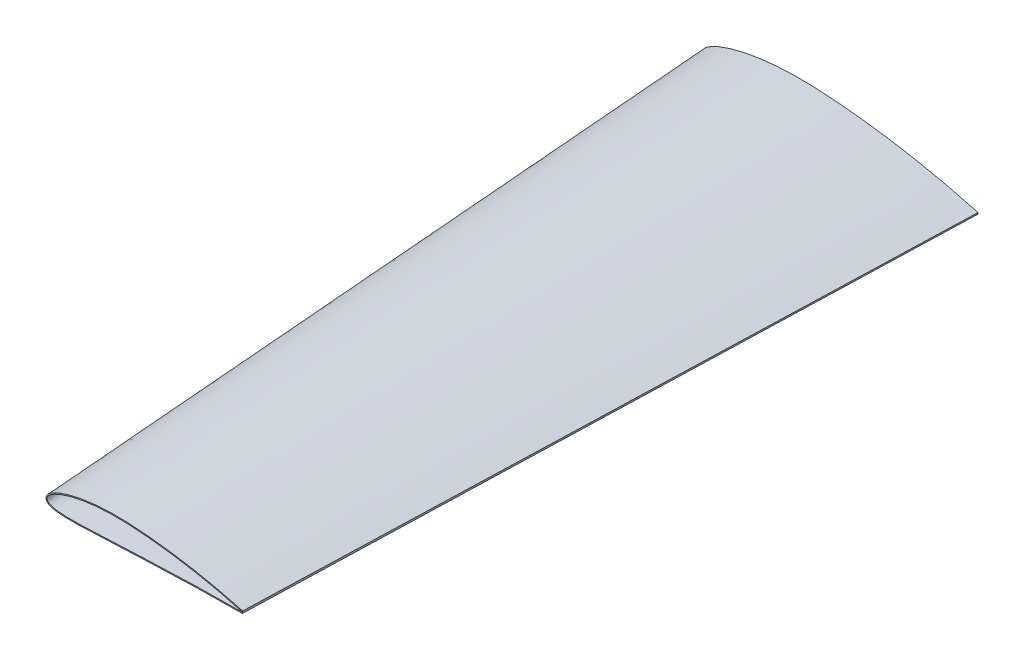
ISO-10303-21;
HEADER;
FILE_DESCRIPTION(('STEP AP214'),'2;1');
FILE_NAME('part.step','',(''),(''),'','','');
FILE_SCHEMA(('AUTOMOTIVE_DESIGN { 1 0 10303 214 1 1 1 1 }'));
ENDSEC;
DATA;
#1=APPLICATION_CONTEXT('core data for automotive mechanical design processes');
#2=APPLICATION_PROTOCOL_DEFINITION('international standard','automotive_design',2000,#1);
#3=PRODUCT_CONTEXT('',#1,'mechanical');
#4=PRODUCT('Part','Part','',(#3));
#5=PRODUCT_RELATED_PRODUCT_CATEGORY('part','',(#4));
#6=PRODUCT_DEFINITION_FORMATION('','',#4);
#7=PRODUCT_DEFINITION_CONTEXT('part definition',#1,'design');
#8=PRODUCT_DEFINITION('design','',#6,#7);
#9=PRODUCT_DEFINITION_SHAPE('','',#8);
#10=(LENGTH_UNIT() NAMED_UNIT(*) SI_UNIT(.MILLI.,.METRE.));
#11=(NAMED_UNIT(*) PLANE_ANGLE_UNIT() SI_UNIT($,.RADIAN.));
#12=(NAMED_UNIT(*) SI_UNIT($,.STERADIAN.) SOLID_ANGLE_UNIT());
#13=UNCERTAINTY_MEASURE_WITH_UNIT(LENGTH_MEASURE(1.E-05),#10,'distance_accuracy_value','');
#14=(GEOMETRIC_REPRESENTATION_CONTEXT(3) GLOBAL_UNCERTAINTY_ASSIGNED_CONTEXT((#13)) GLOBAL_UNIT_ASSIGNED_CONTEXT((#10,
#11,#12)) REPRESENTATION_CONTEXT('',''));
#15=CARTESIAN_POINT('',(0.,0.,0.));
#16=DIRECTION('',(0.,0.,1.));
#17=DIRECTION('',(1.,0.,0.));
#18=AXIS2_PLACEMENT_3D('',#15,#16,#17);
#19=CARTESIAN_POINT('',(515.542466757651,1.37291715323749,0.));
#20=CARTESIAN_POINT('',(473.761354348708,1.91504334392476,1333.5));
#21=CARTESIAN_POINT('',(504.948186056162,4.31562778068404,0.));
#22=CARTESIAN_POINT('',(466.241241660713,4.00387151815679,1333.5));
#23=CARTESIAN_POINT('',(483.688630885925,9.95175823918553,0.));
#24=CARTESIAN_POINT('',(451.160493971408,8.03690502890336,1333.5));
#25=CARTESIAN_POINT('',(440.91840439398,20.2408017386491,0.));
#26=CARTESIAN_POINT('',(420.805599887962,15.3578375738474,1333.5));
#27=CARTESIAN_POINT('',(397.820792051191,29.0759377638442,0.));
#28=CARTESIAN_POINT('',(390.221957363054,21.65962794748,1333.5));
#29=CARTESIAN_POINT('',(354.460600672312,36.4782376927597,0.));
#30=CARTESIAN_POINT('',(359.448862171338,26.9396472162238,1333.5));
#31=CARTESIAN_POINT('',(321.821436127745,41.287280697128,0.));
#32=CARTESIAN_POINT('',(336.282822397605,30.3682918829064,1333.5));
#33=CARTESIAN_POINT('',(289.075414397088,45.3159399144746,0.));
#34=CARTESIAN_POINT('',(313.039072197383,33.2450825322831,1333.5));
#35=CARTESIAN_POINT('',(256.234249309476,48.5142512287238,0.));
#36=CARTESIAN_POINT('',(289.723976775768,35.5318134186845,1333.5));
#37=CARTESIAN_POINT('',(223.317458576892,50.787173233681,0.));
#38=CARTESIAN_POINT('',(266.354818287414,37.1599691175304,1333.5));
#39=CARTESIAN_POINT('',(190.328241158101,52.0921492363557,0.));
#40=CARTESIAN_POINT('',(242.91690860674,38.106258583374,1333.5));
#41=CARTESIAN_POINT('',(162.799790856734,51.7149612737425,0.));
#42=CARTESIAN_POINT('',(223.339605024856,37.8569374336063,1333.5));
#43=CARTESIAN_POINT('',(140.815010685056,50.4814113602434,0.));
#44=CARTESIAN_POINT('',(207.702823599273,36.9927518576321,1333.5));
#45=CARTESIAN_POINT('',(124.359909385153,49.0521108646724,0.));
#46=CARTESIAN_POINT('',(195.99602938729,35.9854835703815,1333.5));
#47=CARTESIAN_POINT('',(107.957329171461,47.0863508807158,0.));
#48=CARTESIAN_POINT('',(184.323035776176,34.59573007404,1333.5));
#49=CARTESIAN_POINT('',(91.631280061329,44.5372092186544,0.));
#50=CARTESIAN_POINT('',(172.700036204777,32.7897404844962,1333.5));
#51=CARTESIAN_POINT('',(75.4136360051635,41.3429509123251,0.));
#52=CARTESIAN_POINT('',(161.148094659947,30.5229468259909,1333.5));
#53=CARTESIAN_POINT('',(62.025702194082,38.0735505204426,0.));
#54=CARTESIAN_POINT('',(151.604465980378,28.1992444571214,1333.5));
#55=CARTESIAN_POINT('',(51.4266197848401,35.0260164169072,0.));
#56=CARTESIAN_POINT('',(144.041887446398,26.0301562795153,1333.5));
#57=CARTESIAN_POINT('',(43.5465568697689,32.4984583099507,0.));
#58=CARTESIAN_POINT('',(138.41449545024,24.2291788913945,1333.5));
#59=CARTESIAN_POINT('',(35.7541118725182,29.6956733272348,0.));
#60=CARTESIAN_POINT('',(132.843221370915,22.2293587302536,1333.5));
#61=CARTESIAN_POINT('',(28.0755124200348,26.5705691180233,0.));
#62=CARTESIAN_POINT('',(127.343608813039,19.9952999808497,1333.5));
#63=CARTESIAN_POINT('',(20.555874406315,23.0470024261619,0.));
#64=CARTESIAN_POINT('',(121.942599672116,17.4689180578259,1333.5));
#65=CARTESIAN_POINT('',(14.4837569810482,19.6800078711009,0.));
#66=CARTESIAN_POINT('',(117.559968245804,15.04337614627,1333.5));
#67=CARTESIAN_POINT('',(9.83082821996991,16.6046362541371,0.));
#68=CARTESIAN_POINT('',(114.174757892656,12.8096231690394,1333.5));
#69=CARTESIAN_POINT('',(6.4884133940203,14.0525883692153,0.));
#70=CARTESIAN_POINT('',(111.721318113505,10.9395579815021,1333.5));
#71=CARTESIAN_POINT('',(3.37411745860041,11.1653229429713,0.));
#72=CARTESIAN_POINT('',(109.404447868835,8.79585196070452,1333.5));
#73=CARTESIAN_POINT('',(1.10893170730452,8.36681188823188,0.));
#74=CARTESIAN_POINT('',(107.664063642287,6.65710221065554,1333.5));
#75=CARTESIAN_POINT('',(-0.301805281426847,5.74949525675526,0.));
#76=CARTESIAN_POINT('',(106.551977804266,4.5904851843582,1333.5));
#77=CARTESIAN_POINT('',(-1.01759194588757,3.60243572224438,0.));
#78=CARTESIAN_POINT('',(105.953611387231,2.81739605685466,1333.5));
#79=CARTESIAN_POINT('',(-1.2495522623254,1.27648595976914,0.));
#80=CARTESIAN_POINT('',(105.759156489465,0.850568134802958,1333.5));
#81=CARTESIAN_POINT('',(-0.871053522600669,-1.0536259455248,0.));
#82=CARTESIAN_POINT('',(106.089924423004,-1.15154539440468,1333.5));
#83=CARTESIAN_POINT('',(0.0925312647460494,-3.18620229908168,0.));
#84=CARTESIAN_POINT('',(106.914986624156,-2.95461732726503,1333.5));
#85=CARTESIAN_POINT('',(1.96587574601528,-5.5997712947529,0.));
#86=CARTESIAN_POINT('',(108.477470245047,-4.94678785829278,1333.5));
#87=CARTESIAN_POINT('',(4.91676019063022,-7.81472721090731,0.));
#88=CARTESIAN_POINT('',(110.800424548259,-6.66376143743772,1333.5));
#89=CARTESIAN_POINT('',(8.76335605849131,-9.68666142986385,0.));
#90=CARTESIAN_POINT('',(113.698800911527,-8.06494132796826,1333.5));
#91=CARTESIAN_POINT('',(12.7457170988457,-11.0838560935036,0.));
#92=CARTESIAN_POINT('',(116.635824452286,-9.08879735743914,1333.5));
#93=CARTESIAN_POINT('',(16.7924123227071,-12.1621059985243,0.));
#94=CARTESIAN_POINT('',(119.584839473497,-9.87029719797451,1333.5));
#95=CARTESIAN_POINT('',(22.2359674012003,-13.2958830810498,0.));
#96=CARTESIAN_POINT('',(123.524096136929,-10.6860636031594,1333.5));
#97=CARTESIAN_POINT('',(29.0875943161226,-14.2923489224896,0.));
#98=CARTESIAN_POINT('',(128.447397124961,-11.3972340966206,1333.5));
#99=CARTESIAN_POINT('',(37.3368750688352,-15.0677746567505,0.));
#100=CARTESIAN_POINT('',(134.349639581766,-11.947718634808,1333.5));
#101=CARTESIAN_POINT('',(45.5951521604237,-15.5505139378374,0.));
#102=CARTESIAN_POINT('',(140.242283827755,-12.2886242625503,1333.5));
#103=CARTESIAN_POINT('',(53.8553570900479,-15.8209667772946,0.));
#104=CARTESIAN_POINT('',(146.127060513623,-12.4782668123123,1333.5));
#105=CARTESIAN_POINT('',(62.1137750735132,-15.9283521329175,0.));
#106=CARTESIAN_POINT('',(152.003712865923,-12.552064863902,1333.5));
#107=CARTESIAN_POINT('',(73.1205588589155,-15.9055453611833,0.));
#108=CARTESIAN_POINT('',(159.829522788246,-12.5328344567209,1333.5));
#109=CARTESIAN_POINT('',(86.8699195436529,-15.6312499740422,0.));
#110=CARTESIAN_POINT('',(169.596582504585,-12.3348738263077,1333.5));
#111=CARTESIAN_POINT('',(103.354857804001,-15.0577240266216,0.));
#112=CARTESIAN_POINT('',(181.297956986089,-11.9250394308122,1333.5));
#113=CARTESIAN_POINT('',(119.82883830323,-14.3351980837164,0.));
#114=CARTESIAN_POINT('',(192.985214326049,-11.4106375817264,1333.5));
#115=CARTESIAN_POINT('',(136.295462455293,-13.5306329693252,0.));
#116=CARTESIAN_POINT('',(204.662814159789,-10.8390693642151,1333.5));
#117=CARTESIAN_POINT('',(158.245357802019,-12.4217886668498,0.));
#118=CARTESIAN_POINT('',(220.224309063749,-10.0527014635403,1333.5));
#119=CARTESIAN_POINT('',(185.677219006089,-11.0451104976105,0.));
#120=CARTESIAN_POINT('',(239.663674820272,-9.07928745888814,1333.5));
#121=CARTESIAN_POINT('',(218.611438330042,-9.79297803817341,0.));
#122=CARTESIAN_POINT('',(263.00207611691,-8.19568423864289,1333.5));
#123=CARTESIAN_POINT('',(251.555145610756,-8.43171617870903,0.));
#124=CARTESIAN_POINT('',(286.363804333461,-7.22745079121833,1333.5));
#125=CARTESIAN_POINT('',(284.490185789946,-7.05887027421826,0.));
#126=CARTESIAN_POINT('',(309.70924451459,-6.25554907479826,1333.5));
#127=CARTESIAN_POINT('',(328.406681851027,-5.3338827127236,0.));
#128=CARTESIAN_POINT('',(340.837133227643,-5.03573266395796,1333.5));
#129=CARTESIAN_POINT('',(383.311814556076,-3.53289934021423,0.));
#130=CARTESIAN_POINT('',(379.748805846812,-3.76689211807182,1333.5));
#131=CARTESIAN_POINT('',(449.217902368611,-2.16377935447564,0.));
#132=CARTESIAN_POINT('',(426.454575487254,-2.80665513508761,1333.5));
#133=CARTESIAN_POINT('',(493.166185563474,-1.76961340399107,0.));
#134=CARTESIAN_POINT('',(457.604517174587,-2.5374479327564,1333.5));
#135=CARTESIAN_POINT('',(515.140000287505,-1.63716151339865,0.));
#136=CARTESIAN_POINT('',(473.17857996649,-2.44353039794196,1333.5));
#137=B_SPLINE_SURFACE_WITH_KNOTS('',3,1,((#19,#20),(#21,#22),(#23,#24),(#25,#26),(#27,#28),(#29,
#30),(#31,#32),(#33,#34),(#35,#36),(#37,#38),(#39,#40),(#41,#42),(#43,#44),(#45,#46),(#47,#48),
(#49,#50),(#51,#52),(#53,#54),(#55,#56),(#57,#58),(#59,#60),(#61,#62),(#63,#64),(#65,#66),(#67,
#68),(#69,#70),(#71,#72),(#73,#74),(#75,#76),(#77,#78),(#79,#80),(#81,#82),(#83,#84),(#85,#86),
(#87,#88),(#89,#90),(#91,#92),(#93,#94),(#95,#96),(#97,#98),(#99,#100),(#101,#102),(#103,#104),
(#105,#106),(#107,#108),(#109,#110),(#111,#112),(#113,#114),(#115,#116),(#117,#118),(#119,#120),
(#121,#122),(#123,#124),(#125,#126),(#127,#128),(#129,#130),(#131,#132),(#133,#134),(#135,
#136)),.UNSPECIFIED.,.F.,.F.,.F.,(4,1,1,1,1,1,1,1,1,1,1,1,1,1,1,1,1,1,1,1,1,1,1,1,1,1,1,1,1,1,1,
1,1,1,1,1,1,1,1,1,1,1,1,1,1,1,1,1,1,1,1,1,1,1,1,1,4),(2,2),(0.,0.03125,0.0625,0.125,0.15625,
0.1875,0.21875,0.25,0.28125,0.3125,0.34375,0.359375,0.375,0.390625,0.40625,0.421875,0.4375,
0.4453125,0.453125,0.4609375,0.46875,0.4765625,0.484375,0.48828125,0.4921875,0.49609375,0.5,
0.501953125,0.50390625,0.505859375,0.5078125,0.509765625,0.51171875,0.515625,0.51953125,
0.5234375,0.52734375,0.53125,0.5390625,0.546875,0.5546875,0.5625,0.5703125,0.578125,0.59375,
0.609375,0.625,0.640625,0.65625,0.6875,0.71875,0.75,0.78125,0.8125,0.875,0.9375,1.),(0.,1.),.UNSPECIFIED.);
#138=CARTESIAN_POINT('',(515.542466757651,1.37291715323749,0.));
#139=CARTESIAN_POINT('',(504.948186056162,4.31562778068404,0.));
#140=CARTESIAN_POINT('',(483.688630885925,9.95175823918553,0.));
#141=CARTESIAN_POINT('',(440.91840439398,20.2408017386491,0.));
#142=CARTESIAN_POINT('',(397.820792051191,29.0759377638442,0.));
#143=CARTESIAN_POINT('',(354.460600672312,36.4782376927597,0.));
#144=CARTESIAN_POINT('',(321.821436127745,41.287280697128,0.));
#145=CARTESIAN_POINT('',(289.075414397088,45.3159399144746,0.));
#146=CARTESIAN_POINT('',(256.234249309476,48.5142512287238,0.));
#147=CARTESIAN_POINT('',(223.317458576892,50.787173233681,0.));
#148=CARTESIAN_POINT('',(190.328241158101,52.0921492363557,0.));
#149=CARTESIAN_POINT('',(162.799790856734,51.7149612737425,0.));
#150=CARTESIAN_POINT('',(140.815010685056,50.4814113602434,0.));
#151=CARTESIAN_POINT('',(124.359909385153,49.0521108646724,0.));
#152=CARTESIAN_POINT('',(107.957329171461,47.0863508807158,0.));
#153=CARTESIAN_POINT('',(91.631280061329,44.5372092186544,0.));
#154=CARTESIAN_POINT('',(75.4136360051635,41.3429509123251,0.));
#155=CARTESIAN_POINT('',(62.025702194082,38.0735505204426,0.));
#156=CARTESIAN_POINT('',(51.4266197848401,35.0260164169072,0.));
#157=CARTESIAN_POINT('',(43.5465568697689,32.4984583099507,0.));
#158=CARTESIAN_POINT('',(35.7541118725182,29.6956733272348,0.));
#159=CARTESIAN_POINT('',(28.0755124200348,26.5705691180233,0.));
#160=CARTESIAN_POINT('',(20.555874406315,23.0470024261619,0.));
#161=CARTESIAN_POINT('',(14.4837569810482,19.6800078711009,0.));
#162=CARTESIAN_POINT('',(9.83082821996991,16.6046362541371,0.));
#163=CARTESIAN_POINT('',(6.4884133940203,14.0525883692153,0.));
#164=CARTESIAN_POINT('',(3.37411745860041,11.1653229429713,0.));
#165=CARTESIAN_POINT('',(1.10893170730452,8.36681188823188,0.));
#166=CARTESIAN_POINT('',(-0.301805281426847,5.74949525675526,0.));
#167=CARTESIAN_POINT('',(-1.01759194588757,3.60243572224438,0.));
#168=CARTESIAN_POINT('',(-1.2495522623254,1.27648595976914,0.));
#169=CARTESIAN_POINT('',(-0.871053522600669,-1.0536259455248,0.));
#170=CARTESIAN_POINT('',(0.0925312647460494,-3.18620229908168,0.));
#171=CARTESIAN_POINT('',(1.96587574601528,-5.5997712947529,0.));
#172=CARTESIAN_POINT('',(4.91676019063022,-7.81472721090731,0.));
#173=CARTESIAN_POINT('',(8.76335605849131,-9.68666142986385,0.));
#174=CARTESIAN_POINT('',(12.7457170988457,-11.0838560935036,0.));
#175=CARTESIAN_POINT('',(16.7924123227071,-12.1621059985243,0.));
#176=CARTESIAN_POINT('',(22.2359674012003,-13.2958830810498,0.));
#177=CARTESIAN_POINT('',(29.0875943161226,-14.2923489224896,0.));
#178=CARTESIAN_POINT('',(37.3368750688352,-15.0677746567505,0.));
#179=CARTESIAN_POINT('',(45.5951521604237,-15.5505139378374,0.));
#180=CARTESIAN_POINT('',(53.8553570900479,-15.8209667772946,0.));
#181=CARTESIAN_POINT('',(62.1137750735132,-15.9283521329175,0.));
#182=CARTESIAN_POINT('',(73.1205588589155,-15.9055453611833,0.));
#183=CARTESIAN_POINT('',(86.8699195436529,-15.6312499740422,0.));
#184=CARTESIAN_POINT('',(103.354857804001,-15.0577240266216,0.));
#185=CARTESIAN_POINT('',(119.82883830323,-14.3351980837164,0.));
#186=CARTESIAN_POINT('',(136.295462455293,-13.5306329693252,0.));
#187=CARTESIAN_POINT('',(158.245357802019,-12.4217886668498,0.));
#188=CARTESIAN_POINT('',(185.677219006089,-11.0451104976105,0.));
#189=CARTESIAN_POINT('',(218.611438330042,-9.79297803817341,0.));
#190=CARTESIAN_POINT('',(251.555145610756,-8.43171617870903,0.));
#191=CARTESIAN_POINT('',(284.490185789946,-7.05887027421826,0.));
#192=CARTESIAN_POINT('',(328.406681851027,-5.3338827127236,0.));
#193=CARTESIAN_POINT('',(383.311814556076,-3.53289934021423,0.));
#194=CARTESIAN_POINT('',(449.217902368611,-2.16377935447564,0.));
#195=CARTESIAN_POINT('',(493.166185563474,-1.76961340399107,0.));
#196=CARTESIAN_POINT('',(515.140000287505,-1.63716151339865,0.));
#197=B_SPLINE_CURVE_WITH_KNOTS('',3,(#138,#139,#140,#141,#142,#143,#144,#145,#146,#147,#148,
#149,#150,#151,#152,#153,#154,#155,#156,#157,#158,#159,#160,#161,#162,#163,#164,#165,#166,#167,
#168,#169,#170,#171,#172,#173,#174,#175,#176,#177,#178,#179,#180,#181,#182,#183,#184,#185,#186,
#187,#188,#189,#190,#191,#192,#193,#194,#195,#196),.UNSPECIFIED.,.F.,.F.,(4,1,1,1,1,1,1,1,1,1,1,
1,1,1,1,1,1,1,1,1,1,1,1,1,1,1,1,1,1,1,1,1,1,1,1,1,1,1,1,1,1,1,1,1,1,1,1,1,1,1,1,1,1,1,1,1,4),
(0.,0.03125,0.0625,0.125,0.15625,0.1875,0.21875,0.25,0.28125,0.3125,0.34375,0.359375,0.375,
0.390625,0.40625,0.421875,0.4375,0.4453125,0.453125,0.4609375,0.46875,0.4765625,0.484375,
0.48828125,0.4921875,0.49609375,0.5,0.501953125,0.50390625,0.505859375,0.5078125,0.509765625,
0.51171875,0.515625,0.51953125,0.5234375,0.52734375,0.53125,0.5390625,0.546875,0.5546875,0.5625,
0.5703125,0.578125,0.59375,0.609375,0.625,0.640625,0.65625,0.6875,0.71875,0.75,0.78125,0.8125,
0.875,0.9375,1.),.UNSPECIFIED.);
#198=CARTESIAN_POINT('',(515.542466757651,1.37291715323749,0.));
#199=VERTEX_POINT('',#198);
#200=CARTESIAN_POINT('',(515.140000287505,-1.63716151339865,0.));
#201=VERTEX_POINT('',#200);
#202=EDGE_CURVE('E12',#199,#201,#197,.T.);
#203=DIRECTION('',(-0.0314515585962615,-0.000604401805953986,0.999505094614491));
#204=VECTOR('',#203,1.);
#205=CARTESIAN_POINT('',(494.159290126997,-2.0403459556703,666.75));
#206=LINE('',#205,#204);
#207=CARTESIAN_POINT('',(473.17857996649,-2.44353039794196,1333.5));
#208=VERTEX_POINT('',#207);
#209=EDGE_CURVE('E110',#201,#208,#206,.T.);
#210=CARTESIAN_POINT('',(473.761354348708,1.91504334392476,1333.5));
#211=CARTESIAN_POINT('',(466.241241660713,4.00387151815679,1333.5));
#212=CARTESIAN_POINT('',(451.160493971408,8.03690502890336,1333.5));
#213=CARTESIAN_POINT('',(420.805599887962,15.3578375738474,1333.5));
#214=CARTESIAN_POINT('',(390.221957363054,21.65962794748,1333.5));
#215=CARTESIAN_POINT('',(359.448862171338,26.9396472162238,1333.5));
#216=CARTESIAN_POINT('',(336.282822397605,30.3682918829064,1333.5));
#217=CARTESIAN_POINT('',(313.039072197383,33.2450825322831,1333.5));
#218=CARTESIAN_POINT('',(289.723976775768,35.5318134186845,1333.5));
#219=CARTESIAN_POINT('',(266.354818287414,37.1599691175304,1333.5));
#220=CARTESIAN_POINT('',(242.91690860674,38.106258583374,1333.5));
#221=CARTESIAN_POINT('',(223.339605024856,37.8569374336063,1333.5));
#222=CARTESIAN_POINT('',(207.702823599273,36.9927518576321,1333.5));
#223=CARTESIAN_POINT('',(195.99602938729,35.9854835703815,1333.5));
#224=CARTESIAN_POINT('',(184.323035776176,34.59573007404,1333.5));
#225=CARTESIAN_POINT('',(172.700036204777,32.7897404844962,1333.5));
#226=CARTESIAN_POINT('',(161.148094659947,30.5229468259909,1333.5));
#227=CARTESIAN_POINT('',(151.604465980378,28.1992444571214,1333.5));
#228=CARTESIAN_POINT('',(144.041887446398,26.0301562795153,1333.5));
#229=CARTESIAN_POINT('',(138.41449545024,24.2291788913945,1333.5));
#230=CARTESIAN_POINT('',(132.843221370915,22.2293587302536,1333.5));
#231=CARTESIAN_POINT('',(127.343608813039,19.9952999808497,1333.5));
#232=CARTESIAN_POINT('',(121.942599672116,17.4689180578259,1333.5));
#233=CARTESIAN_POINT('',(117.559968245804,15.04337614627,1333.5));
#234=CARTESIAN_POINT('',(114.174757892656,12.8096231690394,1333.5));
#235=CARTESIAN_POINT('',(111.721318113505,10.9395579815021,1333.5));
#236=CARTESIAN_POINT('',(109.404447868835,8.79585196070452,1333.5));
#237=CARTESIAN_POINT('',(107.664063642287,6.65710221065554,1333.5));
#238=CARTESIAN_POINT('',(106.551977804266,4.5904851843582,1333.5));
#239=CARTESIAN_POINT('',(105.953611387231,2.81739605685466,1333.5));
#240=CARTESIAN_POINT('',(105.759156489465,0.850568134802958,1333.5));
#241=CARTESIAN_POINT('',(106.089924423004,-1.15154539440468,1333.5));
#242=CARTESIAN_POINT('',(106.914986624156,-2.95461732726503,1333.5));
#243=CARTESIAN_POINT('',(108.477470245047,-4.94678785829278,1333.5));
#244=CARTESIAN_POINT('',(110.800424548259,-6.66376143743772,1333.5));
#245=CARTESIAN_POINT('',(113.698800911527,-8.06494132796826,1333.5));
#246=CARTESIAN_POINT('',(116.635824452286,-9.08879735743914,1333.5));
#247=CARTESIAN_POINT('',(119.584839473497,-9.87029719797451,1333.5));
#248=CARTESIAN_POINT('',(123.524096136929,-10.6860636031594,1333.5));
#249=CARTESIAN_POINT('',(128.447397124961,-11.3972340966206,1333.5));
#250=CARTESIAN_POINT('',(134.349639581766,-11.947718634808,1333.5));
#251=CARTESIAN_POINT('',(140.242283827755,-12.2886242625503,1333.5));
#252=CARTESIAN_POINT('',(146.127060513623,-12.4782668123123,1333.5));
#253=CARTESIAN_POINT('',(152.003712865923,-12.552064863902,1333.5));
#254=CARTESIAN_POINT('',(159.829522788246,-12.5328344567209,1333.5));
#255=CARTESIAN_POINT('',(169.596582504585,-12.3348738263077,1333.5));
#256=CARTESIAN_POINT('',(181.297956986089,-11.9250394308122,1333.5));
#257=CARTESIAN_POINT('',(192.985214326049,-11.4106375817264,1333.5));
#258=CARTESIAN_POINT('',(204.662814159789,-10.8390693642151,1333.5));
#259=CARTESIAN_POINT('',(220.224309063749,-10.0527014635403,1333.5));
#260=CARTESIAN_POINT('',(239.663674820272,-9.07928745888814,1333.5));
#261=CARTESIAN_POINT('',(263.00207611691,-8.19568423864289,1333.5));
#262=CARTESIAN_POINT('',(286.363804333461,-7.22745079121833,1333.5));
#263=CARTESIAN_POINT('',(309.70924451459,-6.25554907479826,1333.5));
#264=CARTESIAN_POINT('',(340.837133227643,-5.03573266395796,1333.5));
#265=CARTESIAN_POINT('',(379.748805846812,-3.76689211807182,1333.5));
#266=CARTESIAN_POINT('',(426.454575487254,-2.80665513508761,1333.5));
#267=CARTESIAN_POINT('',(457.604517174587,-2.5374479327564,1333.5));
#268=CARTESIAN_POINT('',(473.17857996649,-2.44353039794196,1333.5));
#269=B_SPLINE_CURVE_WITH_KNOTS('',3,(#210,#211,#212,#213,#214,#215,#216,#217,#218,#219,#220,
#221,#222,#223,#224,#225,#226,#227,#228,#229,#230,#231,#232,#233,#234,#235,#236,#237,#238,#239,
#240,#241,#242,#243,#244,#245,#246,#247,#248,#249,#250,#251,#252,#253,#254,#255,#256,#257,#258,
#259,#260,#261,#262,#263,#264,#265,#266,#267,#268),.UNSPECIFIED.,.F.,.F.,(4,1,1,1,1,1,1,1,1,1,1,
1,1,1,1,1,1,1,1,1,1,1,1,1,1,1,1,1,1,1,1,1,1,1,1,1,1,1,1,1,1,1,1,1,1,1,1,1,1,1,1,1,1,1,1,1,4),
(0.,0.03125,0.0625,0.125,0.15625,0.1875,0.21875,0.25,0.28125,0.3125,0.34375,0.359375,0.375,
0.390625,0.40625,0.421875,0.4375,0.4453125,0.453125,0.4609375,0.46875,0.4765625,0.484375,
0.48828125,0.4921875,0.49609375,0.5,0.501953125,0.50390625,0.505859375,0.5078125,0.509765625,
0.51171875,0.515625,0.51953125,0.5234375,0.52734375,0.53125,0.5390625,0.546875,0.5546875,0.5625,
0.5703125,0.578125,0.59375,0.609375,0.625,0.640625,0.65625,0.6875,0.71875,0.75,0.78125,0.8125,
0.875,0.9375,1.),.UNSPECIFIED.);
#270=CARTESIAN_POINT('',(473.761354348708,1.91504334392476,1333.5));
#271=VERTEX_POINT('',#270);
#272=EDGE_CURVE('E156',#271,#208,#269,.T.);
#273=DIRECTION('',(-0.0313165474447222,0.000406344388476608,0.999509434042711));
#274=VECTOR('',#273,1.);
#275=CARTESIAN_POINT('',(494.651910553179,1.64398024858112,666.75));
#276=LINE('',#275,#274);
#277=EDGE_CURVE('E173',#199,#271,#276,.T.);
#278=ORIENTED_EDGE('',*,*,#202,.T.);
#279=ORIENTED_EDGE('',*,*,#209,.T.);
#280=ORIENTED_EDGE('',*,*,#272,.F.);
#281=ORIENTED_EDGE('',*,*,#277,.F.);
#282=EDGE_LOOP('',(#278,#279,#280,#281));
#283=FACE_BOUND('',#282,.T.);
#284=ADVANCED_FACE('F101',(#283),#137,.T.);
#285=CARTESIAN_POINT('',(515.140000287505,-1.63716151339865,0.));
#286=DIRECTION('',(0.99070012302079,-0.132462844212288,0.0310943909697982));
#287=DIRECTION('',(0.13252692727453,0.991179405328405,0.));
#288=AXIS2_PLACEMENT_3D('',#285,#286,#287);
#289=PLANE('',#288);
#290=DIRECTION('',(0.13252692727453,0.991179405328405,0.));
#291=VECTOR('',#290,1.);
#292=CARTESIAN_POINT('',(515.341233522578,-0.132122180080578,0.));
#293=LINE('',#292,#291);
#294=EDGE_CURVE('E179',#201,#199,#293,.T.);
#295=ORIENTED_EDGE('',*,*,#294,.T.);
#296=ORIENTED_EDGE('',*,*,#277,.T.);
#297=DIRECTION('',(0.13252818509165,0.991179237149524,0.));
#298=VECTOR('',#297,1.);
#299=CARTESIAN_POINT('',(473.469967157599,-0.264243527008601,1333.5));
#300=LINE('',#299,#298);
#301=EDGE_CURVE('E105',#208,#271,#300,.T.);
#302=ORIENTED_EDGE('',*,*,#301,.F.);
#303=ORIENTED_EDGE('',*,*,#209,.F.);
#304=EDGE_LOOP('',(#295,#296,#302,#303));
#305=FACE_BOUND('',#304,.T.);
#306=ADVANCED_FACE('F103',(#305),#289,.T.);
#307=CARTESIAN_POINT('',(0.789698427813787,7.6809404147223,0.));
#308=DIRECTION('',(0.,0.,-1.));
#309=DIRECTION('',(-1.,0.,0.));
#310=AXIS2_PLACEMENT_3D('',#307,#308,#309);
#311=PLANE('',#310);
#312=DIRECTION('',(0.132526927273884,0.991179405328492,0.));
#313=VECTOR('',#312,1.);
#314=CARTESIAN_POINT('',(514.35,0.,0.));
#315=LINE('',#314,#313);
#316=CARTESIAN_POINT('',(514.264104,-0.642423,0.));
#317=VERTEX_POINT('',#316);
#318=CARTESIAN_POINT('',(514.435896,0.642423,0.));
#319=VERTEX_POINT('',#318);
#320=EDGE_CURVE('E148',#317,#319,#315,.T.);
#321=ORIENTED_EDGE('',*,*,#320,.T.);
#322=CARTESIAN_POINT('',(514.435896,0.642423,0.));
#323=CARTESIAN_POINT('',(512.94541606473,1.05642478729432,0.));
#324=CARTESIAN_POINT('',(508.825527987807,2.19256313847687,0.));
#325=CARTESIAN_POINT('',(498.403665900981,5.01203318174744,0.));
#326=CARTESIAN_POINT('',(480.522495849854,9.65821949062991,0.));
#327=CARTESIAN_POINT('',(461.6976352898,14.2178535400194,0.));
#328=CARTESIAN_POINT('',(441.398480906032,18.8488091834658,0.));
#329=CARTESIAN_POINT('',(425.837811960539,22.2064809442018,0.));
#330=CARTESIAN_POINT('',(404.739444713579,26.4880124213888,0.));
#331=CARTESIAN_POINT('',(386.633295981129,29.9022035696143,0.));
#332=CARTESIAN_POINT('',(367.797715069162,33.1789779456841,0.));
#333=CARTESIAN_POINT('',(347.785757595347,36.4491216571071,0.));
#334=CARTESIAN_POINT('',(321.929657212203,40.2530036004365,0.));
#335=CARTESIAN_POINT('',(290.1575236074,44.1855594770424,0.));
#336=CARTESIAN_POINT('',(263.205160570892,46.8408013496332,0.));
#337=CARTESIAN_POINT('',(241.481594589181,48.5315437184497,0.));
#338=CARTESIAN_POINT('',(225.228952555751,49.5578635284934,0.));
#339=CARTESIAN_POINT('',(209.026056900066,50.3454166531266,0.));
#340=CARTESIAN_POINT('',(192.91849394169,50.8313771990957,0.));
#341=CARTESIAN_POINT('',(176.973461880223,50.8910826974378,0.));
#342=CARTESIAN_POINT('',(156.379693514986,50.443365915704,0.));
#343=CARTESIAN_POINT('',(131.753417716594,48.9407852546156,0.));
#344=CARTESIAN_POINT('',(108.05912810278,46.1590202990312,0.));
#345=CARTESIAN_POINT('',(90.3059853486501,43.2428512836833,0.));
#346=CARTESIAN_POINT('',(77.9859974202083,40.8195537307709,0.));
#347=CARTESIAN_POINT('',(66.4275233836712,38.1487409922866,0.));
#348=CARTESIAN_POINT('',(55.6793455107768,35.2676421154893,0.));
#349=CARTESIAN_POINT('',(45.7858241467059,32.2152976573816,0.));
#350=CARTESIAN_POINT('',(36.7859672757282,29.0315137261456,0.));
#351=CARTESIAN_POINT('',(28.7128278267648,25.7579258766505,0.));
#352=CARTESIAN_POINT('',(21.5951478101318,22.4321597042956,0.));
#353=CARTESIAN_POINT('',(15.4550025655565,19.0919579210996,0.));
#354=CARTESIAN_POINT('',(10.3087653268058,15.7705328063585,0.));
#355=CARTESIAN_POINT('',(6.16514914406117,12.4956664129553,0.));
#356=CARTESIAN_POINT('',(3.02641944483636,9.28349534240597,0.));
#357=CARTESIAN_POINT('',(0.892546496087793,6.13234383969225,0.));
#358=CARTESIAN_POINT('',(-0.207749289706149,3.01155653148428,0.));
#359=CARTESIAN_POINT('',(-0.180705806156611,-0.0362548467185213,0.));
#360=CARTESIAN_POINT('',(0.964936352383728,-2.85745424735354,0.));
#361=CARTESIAN_POINT('',(3.15942728449595,-5.31808870006715,0.));
#362=CARTESIAN_POINT('',(6.28988095208388,-7.43127852790095,0.));
#363=CARTESIAN_POINT('',(10.3346827005672,-9.249116332702,0.));
#364=CARTESIAN_POINT('',(15.2853400246204,-10.7963791421872,0.));
#365=CARTESIAN_POINT('',(21.128740187722,-12.0830529684782,0.));
#366=CARTESIAN_POINT('',(27.8434078851453,-13.1181164538871,0.));
#367=CARTESIAN_POINT('',(35.402386955595,-13.909930601921,0.));
#368=CARTESIAN_POINT('',(43.774859618114,-14.4685589897819,0.));
#369=CARTESIAN_POINT('',(52.9268307234789,-14.8088115512827,0.));
#370=CARTESIAN_POINT('',(62.8222991220521,-14.9425562599767,0.));
#371=CARTESIAN_POINT('',(73.4230791296659,-14.8903632448912,0.));
#372=CARTESIAN_POINT('',(84.6899003138328,-14.669251653047,0.));
#373=CARTESIAN_POINT('',(96.5819965888191,-14.3020165903753,0.));
#374=CARTESIAN_POINT('',(113.568649316398,-13.6339776986205,0.));
#375=CARTESIAN_POINT('',(136.038145587383,-12.55213020457,0.));
#376=CARTESIAN_POINT('',(159.255895604522,-11.3625421508041,0.));
#377=CARTESIAN_POINT('',(178.63980440041,-10.426403347717,0.));
#378=CARTESIAN_POINT('',(193.687789822616,-9.74571384869642,0.));
#379=CARTESIAN_POINT('',(209.076975035284,-9.14665953276347,0.));
#380=CARTESIAN_POINT('',(224.747841415959,-8.53645233231427,0.));
#381=CARTESIAN_POINT('',(251.268043050231,-7.44592583941877,0.));
#382=CARTESIAN_POINT('',(288.183310261078,-5.89213782868748,0.));
#383=CARTESIAN_POINT('',(324.855252418006,-4.48957076349408,0.));
#384=CARTESIAN_POINT('',(350.49312127892,-3.63029902647992,0.));
#385=CARTESIAN_POINT('',(378.655916259754,-2.75217689665205,0.));
#386=CARTESIAN_POINT('',(405.834971812742,-2.0685118801751,0.));
#387=CARTESIAN_POINT('',(435.510495417732,-1.50653575485183,0.));
#388=CARTESIAN_POINT('',(456.175948723462,-1.17512970443536,0.));
#389=CARTESIAN_POINT('',(475.257418188367,-0.951341238396082,0.));
#390=CARTESIAN_POINT('',(490.933297619623,-0.80445748931804,0.));
#391=CARTESIAN_POINT('',(500.158698947766,-0.732541232247515,0.));
#392=CARTESIAN_POINT('',(508.450560131903,-0.676259098232435,0.));
#393=CARTESIAN_POINT('',(512.718654990296,-0.651738526034978,0.));
#394=CARTESIAN_POINT('',(514.264104,-0.642423,0.));
#395=B_SPLINE_CURVE_WITH_KNOTS('',3,(#322,#323,#324,#325,#326,#327,#328,#329,#330,#331,#332,
#333,#334,#335,#336,#337,#338,#339,#340,#341,#342,#343,#344,#345,#346,#347,#348,#349,#350,#351,
#352,#353,#354,#355,#356,#357,#358,#359,#360,#361,#362,#363,#364,#365,#366,#367,#368,#369,#370,
#371,#372,#373,#374,#375,#376,#377,#378,#379,#380,#381,#382,#383,#384,#385,#386,#387,#388,#389,
#390,#391,#392,#393,#394),.UNSPECIFIED.,.F.,.F.,(4,1,1,1,1,1,1,1,1,1,1,1,1,1,1,1,1,1,1,1,1,1,1,
1,1,1,1,1,1,1,1,1,1,1,1,1,1,1,1,1,1,1,1,1,1,1,1,1,1,1,1,1,1,1,1,1,1,1,1,1,1,1,1,1,1,1,1,1,1,1,
4),(0.,0.00440644036857422,0.0121737299937428,0.0307541939074956,0.0570317960242728,
0.0673450879951363,0.0900623576232318,0.10237566463772,0.128668991756761,0.142544998543184,
0.15683462681616,0.18642899877217,0.216985200702991,0.248022540320765,0.263568549379391,
0.27905079415257,0.294409505596858,0.30977601328067,0.324950675699587,0.339824563938648,
0.368445781112026,0.395201613054168,0.407751474728481,0.419686063023906,0.43096195418779,
0.441537442035329,0.451376775359951,0.460447411472792,0.468722554437909,0.476182575407291,
0.482814921279424,0.488618662978692,0.493609654903146,0.497829924786717,0.501364693853581,
0.504371830566402,0.507112524612496,0.509853114307978,0.512854812617694,0.516367768618666,
0.52053959257564,0.525445047045249,0.531118392327961,0.537568297479124,0.544788289677284,
0.552761790220897,0.561466342861132,0.570873121381836,0.580950014659322,0.591662173849693,
0.602972463274888,0.614840808775719,0.640086430252391,0.667051539604885,0.681064303706584,
0.695366712683046,0.709960021857495,0.724934164323908,0.740039734181759,0.785567804764558,
0.830182037591703,0.844577388167962,0.858639375621105,0.910443941544171,0.922021682965094,
0.943186534459237,0.969317876146513,0.976379715358717,0.987841938817817,0.99559763857599,1.),.UNSPECIFIED.);
#396=EDGE_CURVE('E141',#319,#317,#395,.T.);
#397=ORIENTED_EDGE('',*,*,#396,.T.);
#398=EDGE_LOOP('',(#321,#397));
#399=FACE_BOUND('',#398,.T.);
#400=ORIENTED_EDGE('',*,*,#294,.F.);
#401=ORIENTED_EDGE('',*,*,#202,.F.);
#402=EDGE_LOOP('',(#400,#401));
#403=FACE_BOUND('',#402,.T.);
#404=ADVANCED_FACE('F153',(#399,#403),#311,.T.);
#405=CARTESIAN_POINT('',(107.40939397805,6.11081318522634,1333.5));
#406=DIRECTION('',(0.,0.,-1.));
#407=DIRECTION('',(-1.,0.,0.));
#408=AXIS2_PLACEMENT_3D('',#405,#406,#407);
#409=PLANE('',#408);
#410=CARTESIAN_POINT('',(471.548210999999,0.454057999987208,1333.5));
#411=CARTESIAN_POINT('',(470.494753754272,0.746672122477082,1333.5));
#412=CARTESIAN_POINT('',(467.582858646706,1.5496815807817,1333.5));
#413=CARTESIAN_POINT('',(460.216788574629,3.54245650519408,1333.5));
#414=CARTESIAN_POINT('',(447.578553463452,6.82633180706164,1333.5));
#415=CARTESIAN_POINT('',(434.273328814241,10.0490386732759,1333.5));
#416=CARTESIAN_POINT('',(419.926087189139,13.3221532297202,1333.5));
#417=CARTESIAN_POINT('',(408.927959425464,15.6953211175711,1333.5));
#418=CARTESIAN_POINT('',(394.015842123828,18.7214664036661,1333.5));
#419=CARTESIAN_POINT('',(381.218595098486,21.1345812654302,1333.5));
#420=CARTESIAN_POINT('',(367.905792856357,23.4505740973592,1333.5));
#421=CARTESIAN_POINT('',(353.761538310277,25.7618787300853,1333.5));
#422=CARTESIAN_POINT('',(335.486701716051,28.4504232108985,1333.5));
#423=CARTESIAN_POINT('',(313.030471822044,31.2299172839469,1333.5));
#424=CARTESIAN_POINT('',(293.980807719015,33.1066147362166,1333.5));
#425=CARTESIAN_POINT('',(278.626806044593,34.3016163153823,1333.5));
#426=CARTESIAN_POINT('',(267.139599487229,35.0270082162218,1333.5));
#427=CARTESIAN_POINT('',(255.68755287874,35.5836425109885,1333.5));
#428=CARTESIAN_POINT('',(244.302886345107,35.927115011996,1333.5));
#429=CARTESIAN_POINT('',(233.03309484109,35.9693136697484,1333.5));
#430=CARTESIAN_POINT('',(218.477622951542,35.6528728571563,1333.5));
#431=CARTESIAN_POINT('',(201.072014755019,34.5908623765454,1333.5));
#432=CARTESIAN_POINT('',(184.325124716788,32.6247399387227,1333.5));
#433=CARTESIAN_POINT('',(171.777378415618,30.5636207824256,1333.5));
#434=CARTESIAN_POINT('',(163.069732670962,28.8508575855725,1333.5));
#435=CARTESIAN_POINT('',(154.900317065627,26.9631539946023,1333.5));
#436=CARTESIAN_POINT('',(147.303611251825,24.9268214541628,1333.5));
#437=CARTESIAN_POINT('',(140.310968151963,22.769453635662,1333.5));
#438=CARTESIAN_POINT('',(133.949958304024,20.5191869488186,1333.5));
#439=CARTESIAN_POINT('',(128.243943222938,18.2054477590111,1333.5));
#440=CARTESIAN_POINT('',(123.213237815739,15.8548286689227,1333.5));
#441=CARTESIAN_POINT('',(118.873443260835,13.4940076202957,1333.5));
#442=CARTESIAN_POINT('',(115.236133633843,11.1464567811042,1333.5));
#443=CARTESIAN_POINT('',(112.307465918484,8.83181420624795,1333.5));
#444=CARTESIAN_POINT('',(110.08904347215,6.5614828531469,1333.5));
#445=CARTESIAN_POINT('',(108.580843334353,4.33427994666272,1333.5));
#446=CARTESIAN_POINT('',(107.80316531111,2.12853842165356,1333.5));
#447=CARTESIAN_POINT('',(107.822278679744,-0.0256246268723389,1333.5));
#448=CARTESIAN_POINT('',(108.632008069895,-2.01962024822909,1333.5));
#449=CARTESIAN_POINT('',(110.183051961843,-3.75877273588915,1333.5));
#450=CARTESIAN_POINT('',(112.395626013006,-5.25235382542728,1333.5));
#451=CARTESIAN_POINT('',(115.25445101078,-6.53718512599626,1333.5));
#452=CARTESIAN_POINT('',(118.753527326803,-7.63077372493691,1333.5));
#453=CARTESIAN_POINT('',(122.883584864182,-8.5401822189999,1333.5));
#454=CARTESIAN_POINT('',(127.629445640547,-9.27175628389868,1333.5));
#455=CARTESIAN_POINT('',(132.972057337769,-9.83140097628574,1333.5));
#456=CARTESIAN_POINT('',(138.889638054262,-10.2262353599569,1333.5));
#457=CARTESIAN_POINT('',(145.358160775775,-10.4667209136588,1333.5));
#458=CARTESIAN_POINT('',(152.352180294713,-10.5612512049219,1333.5));
#459=CARTESIAN_POINT('',(159.844707071525,-10.5243613303354,1333.5));
#460=CARTESIAN_POINT('',(167.807985065512,-10.3680815224385,1333.5));
#461=CARTESIAN_POINT('',(176.213201295296,-10.1085245112694,1333.5));
#462=CARTESIAN_POINT('',(188.219199631016,-9.63635992298278,1333.5));
#463=CARTESIAN_POINT('',(204.100417700833,-8.87171960345737,1333.5));
#464=CARTESIAN_POINT('',(220.510493957693,-8.03093220714318,1333.5));
#465=CARTESIAN_POINT('',(234.210849069535,-7.36927959083769,1333.5));
#466=CARTESIAN_POINT('',(244.846616793399,-6.88817544351863,1333.5));
#467=CARTESIAN_POINT('',(255.72354084923,-6.4647680381547,1333.5));
#468=CARTESIAN_POINT('',(266.799554765253,-6.03348112050647,1333.5));
#469=CARTESIAN_POINT('',(285.543771333332,-5.26270616042734,1333.5));
#470=CARTESIAN_POINT('',(311.635117149994,-4.16450503488361,1333.5));
#471=CARTESIAN_POINT('',(337.554484160904,-3.17318302443308,1333.5));
#472=CARTESIAN_POINT('',(355.67507629834,-2.56585970842198,1333.5));
#473=CARTESIAN_POINT('',(375.580262074813,-1.94521060265128,1333.5));
#474=CARTESIAN_POINT('',(394.790150732246,-1.4620028025464,1333.5));
#475=CARTESIAN_POINT('',(415.764516641898,-1.06480467367074,1333.5));
#476=CARTESIAN_POINT('',(430.370654857757,-0.830568995520572,1333.5));
#477=CARTESIAN_POINT('',(443.857249442588,-0.672400602459617,1333.5));
#478=CARTESIAN_POINT('',(454.936805434006,-0.568581926745332,1333.5));
#479=CARTESIAN_POINT('',(461.457228295663,-0.517751755927463,1333.5));
#480=CARTESIAN_POINT('',(467.317833669565,-0.477973145484204,1333.5));
#481=CARTESIAN_POINT('',(470.334484120158,-0.460645014779035,1333.5));
#482=CARTESIAN_POINT('',(471.426788999999,-0.454058000012805,1333.5));
#483=B_SPLINE_CURVE_WITH_KNOTS('',3,(#410,#411,#412,#413,#414,#415,#416,#417,#418,#419,#420,
#421,#422,#423,#424,#425,#426,#427,#428,#429,#430,#431,#432,#433,#434,#435,#436,#437,#438,#439,
#440,#441,#442,#443,#444,#445,#446,#447,#448,#449,#450,#451,#452,#453,#454,#455,#456,#457,#458,
#459,#460,#461,#462,#463,#464,#465,#466,#467,#468,#469,#470,#471,#472,#473,#474,#475,#476,#477,
#478,#479,#480,#481,#482),.UNSPECIFIED.,.F.,.F.,(4,1,1,1,1,1,1,1,1,1,1,1,1,1,1,1,1,1,1,1,1,1,1,
1,1,1,1,1,1,1,1,1,1,1,1,1,1,1,1,1,1,1,1,1,1,1,1,1,1,1,1,1,1,1,1,1,1,1,1,1,1,1,1,1,1,1,1,1,1,1,
4),(0.,0.00440644036857422,0.0121737299937428,0.0307541939074956,0.0570317960242728,
0.0673450879951363,0.0900623576232318,0.10237566463772,0.128668991756761,0.142544998543184,
0.15683462681616,0.18642899877217,0.216985200702991,0.248022540320765,0.263568549379391,
0.27905079415257,0.294409505596858,0.30977601328067,0.324950675699587,0.339824563938648,
0.368445781112026,0.395201613054168,0.407751474728481,0.419686063023906,0.43096195418779,
0.441537442035329,0.451376775359951,0.460447411472792,0.468722554437909,0.476182575407291,
0.482814921279424,0.488618662978692,0.493609654903146,0.497829924786717,0.501364693853581,
0.504371830566402,0.507112524612496,0.509853114307978,0.512854812617694,0.516367768618666,
0.52053959257564,0.525445047045249,0.531118392327961,0.537568297479124,0.544788289677284,
0.552761790220897,0.561466342861132,0.570873121381836,0.580950014659322,0.591662173849693,
0.602972463274888,0.614840808775719,0.640086430252391,0.667051539604885,0.681064303706584,
0.695366712683046,0.709960021857495,0.724934164323908,0.740039734181759,0.785567804764558,
0.830182037591703,0.844577388167962,0.858639375621105,0.910443941544171,0.922021682965094,
0.943186534459237,0.969317876146513,0.976379715358717,0.987841938817817,0.99559763857599,1.),.UNSPECIFIED.);
#484=CARTESIAN_POINT('',(471.548210999999,0.454057999987209,1333.5));
#485=VERTEX_POINT('',#484);
#486=CARTESIAN_POINT('',(471.426788999999,-0.454058000012805,1333.5));
#487=VERTEX_POINT('',#486);
#488=EDGE_CURVE('E158',#485,#487,#483,.T.);
#489=ORIENTED_EDGE('',*,*,#488,.F.);
#490=DIRECTION('',(0.132528185092149,0.991179237149458,0.));
#491=VECTOR('',#490,1.);
#492=CARTESIAN_POINT('',(471.487499999999,-1.27983561248879E-11,1333.5));
#493=LINE('',#492,#491);
#494=EDGE_CURVE('E150',#487,#485,#493,.T.);
#495=ORIENTED_EDGE('',*,*,#494,.F.);
#496=EDGE_LOOP('',(#489,#495));
#497=FACE_BOUND('',#496,.T.);
#498=ORIENTED_EDGE('',*,*,#272,.T.);
#499=ORIENTED_EDGE('',*,*,#301,.T.);
#500=EDGE_LOOP('',(#498,#499));
#501=FACE_BOUND('',#500,.T.);
#502=ADVANCED_FACE('F188',(#497,#501),#409,.F.);
#503=CARTESIAN_POINT('',(514.264104,-0.642423,0.));
#504=DIRECTION('',(0.990676755749762,-0.132459719860366,0.0318431818705373));
#505=DIRECTION('',(0.132526927273884,0.991179405328492,0.));
#506=AXIS2_PLACEMENT_3D('',#503,#504,#505);
#507=PLANE('',#506);
#508=ORIENTED_EDGE('',*,*,#320,.F.);
#509=DIRECTION('',(-0.0321074080934547,0.000141183263356079,0.999484414292092));
#510=VECTOR('',#509,1.);
#511=CARTESIAN_POINT('',(492.8454465,-0.548240500006403,666.75));
#512=LINE('',#511,#510);
#513=EDGE_CURVE('E118',#317,#487,#512,.T.);
#514=ORIENTED_EDGE('',*,*,#513,.T.);
#515=ORIENTED_EDGE('',*,*,#494,.T.);
#516=DIRECTION('',(-0.0321451224088134,-0.000141183092138155,0.999483202046266));
#517=VECTOR('',#516,1.);
#518=CARTESIAN_POINT('',(492.992053499999,0.548240499993604,666.75));
#519=LINE('',#518,#517);
#520=EDGE_CURVE('E123',#319,#485,#519,.T.);
#521=ORIENTED_EDGE('',*,*,#520,.F.);
#522=EDGE_LOOP('',(#508,#514,#515,#521));
#523=FACE_BOUND('',#522,.T.);
#524=ADVANCED_FACE('F147',(#523),#507,.F.);
#525=CARTESIAN_POINT('',(514.435896,0.642423,0.));
#526=CARTESIAN_POINT('',(471.548210999999,0.454057999987208,1333.5));
#527=CARTESIAN_POINT('',(512.94541606473,1.05642478729432,0.));
#528=CARTESIAN_POINT('',(470.494753754272,0.746672122477082,1333.5));
#529=CARTESIAN_POINT('',(508.825527987807,2.19256313847687,0.));
#530=CARTESIAN_POINT('',(467.582858646706,1.5496815807817,1333.5));
#531=CARTESIAN_POINT('',(498.403665900981,5.01203318174744,0.));
#532=CARTESIAN_POINT('',(460.216788574629,3.54245650519408,1333.5));
#533=CARTESIAN_POINT('',(480.522495849854,9.65821949062991,0.));
#534=CARTESIAN_POINT('',(447.578553463452,6.82633180706164,1333.5));
#535=CARTESIAN_POINT('',(461.6976352898,14.2178535400194,0.));
#536=CARTESIAN_POINT('',(434.273328814241,10.0490386732759,1333.5));
#537=CARTESIAN_POINT('',(441.398480906032,18.8488091834658,0.));
#538=CARTESIAN_POINT('',(419.926087189139,13.3221532297202,1333.5));
#539=CARTESIAN_POINT('',(425.837811960539,22.2064809442018,0.));
#540=CARTESIAN_POINT('',(408.927959425464,15.6953211175711,1333.5));
#541=CARTESIAN_POINT('',(404.739444713579,26.4880124213888,0.));
#542=CARTESIAN_POINT('',(394.015842123828,18.7214664036661,1333.5));
#543=CARTESIAN_POINT('',(386.633295981129,29.9022035696143,0.));
#544=CARTESIAN_POINT('',(381.218595098486,21.1345812654302,1333.5));
#545=CARTESIAN_POINT('',(367.797715069162,33.1789779456841,0.));
#546=CARTESIAN_POINT('',(367.905792856357,23.4505740973592,1333.5));
#547=CARTESIAN_POINT('',(347.785757595347,36.4491216571071,0.));
#548=CARTESIAN_POINT('',(353.761538310277,25.7618787300853,1333.5));
#549=CARTESIAN_POINT('',(321.929657212203,40.2530036004365,0.));
#550=CARTESIAN_POINT('',(335.486701716051,28.4504232108985,1333.5));
#551=CARTESIAN_POINT('',(290.1575236074,44.1855594770424,0.));
#552=CARTESIAN_POINT('',(313.030471822044,31.2299172839469,1333.5));
#553=CARTESIAN_POINT('',(263.205160570892,46.8408013496332,0.));
#554=CARTESIAN_POINT('',(293.980807719015,33.1066147362166,1333.5));
#555=CARTESIAN_POINT('',(241.481594589181,48.5315437184497,0.));
#556=CARTESIAN_POINT('',(278.626806044593,34.3016163153823,1333.5));
#557=CARTESIAN_POINT('',(225.228952555751,49.5578635284934,0.));
#558=CARTESIAN_POINT('',(267.139599487229,35.0270082162218,1333.5));
#559=CARTESIAN_POINT('',(209.026056900066,50.3454166531266,0.));
#560=CARTESIAN_POINT('',(255.68755287874,35.5836425109885,1333.5));
#561=CARTESIAN_POINT('',(192.91849394169,50.8313771990957,0.));
#562=CARTESIAN_POINT('',(244.302886345107,35.927115011996,1333.5));
#563=CARTESIAN_POINT('',(176.973461880223,50.8910826974378,0.));
#564=CARTESIAN_POINT('',(233.03309484109,35.9693136697484,1333.5));
#565=CARTESIAN_POINT('',(156.379693514986,50.443365915704,0.));
#566=CARTESIAN_POINT('',(218.477622951542,35.6528728571563,1333.5));
#567=CARTESIAN_POINT('',(131.753417716594,48.9407852546156,0.));
#568=CARTESIAN_POINT('',(201.072014755019,34.5908623765454,1333.5));
#569=CARTESIAN_POINT('',(108.05912810278,46.1590202990312,0.));
#570=CARTESIAN_POINT('',(184.325124716788,32.6247399387227,1333.5));
#571=CARTESIAN_POINT('',(90.3059853486501,43.2428512836833,0.));
#572=CARTESIAN_POINT('',(171.777378415618,30.5636207824256,1333.5));
#573=CARTESIAN_POINT('',(77.9859974202083,40.8195537307709,0.));
#574=CARTESIAN_POINT('',(163.069732670962,28.8508575855725,1333.5));
#575=CARTESIAN_POINT('',(66.4275233836712,38.1487409922866,0.));
#576=CARTESIAN_POINT('',(154.900317065627,26.9631539946023,1333.5));
#577=CARTESIAN_POINT('',(55.6793455107768,35.2676421154893,0.));
#578=CARTESIAN_POINT('',(147.303611251825,24.9268214541628,1333.5));
#579=CARTESIAN_POINT('',(45.7858241467059,32.2152976573816,0.));
#580=CARTESIAN_POINT('',(140.310968151963,22.769453635662,1333.5));
#581=CARTESIAN_POINT('',(36.7859672757282,29.0315137261456,0.));
#582=CARTESIAN_POINT('',(133.949958304024,20.5191869488186,1333.5));
#583=CARTESIAN_POINT('',(28.7128278267648,25.7579258766505,0.));
#584=CARTESIAN_POINT('',(128.243943222938,18.2054477590111,1333.5));
#585=CARTESIAN_POINT('',(21.5951478101318,22.4321597042956,0.));
#586=CARTESIAN_POINT('',(123.213237815739,15.8548286689227,1333.5));
#587=CARTESIAN_POINT('',(15.4550025655565,19.0919579210996,0.));
#588=CARTESIAN_POINT('',(118.873443260835,13.4940076202957,1333.5));
#589=CARTESIAN_POINT('',(10.3087653268058,15.7705328063585,0.));
#590=CARTESIAN_POINT('',(115.236133633843,11.1464567811042,1333.5));
#591=CARTESIAN_POINT('',(6.16514914406117,12.4956664129553,0.));
#592=CARTESIAN_POINT('',(112.307465918484,8.83181420624795,1333.5));
#593=CARTESIAN_POINT('',(3.02641944483636,9.28349534240597,0.));
#594=CARTESIAN_POINT('',(110.08904347215,6.5614828531469,1333.5));
#595=CARTESIAN_POINT('',(0.892546496087793,6.13234383969225,0.));
#596=CARTESIAN_POINT('',(108.580843334353,4.33427994666272,1333.5));
#597=CARTESIAN_POINT('',(-0.207749289706149,3.01155653148428,0.));
#598=CARTESIAN_POINT('',(107.80316531111,2.12853842165356,1333.5));
#599=CARTESIAN_POINT('',(-0.180705806156611,-0.0362548467185213,0.));
#600=CARTESIAN_POINT('',(107.822278679744,-0.0256246268723389,1333.5));
#601=CARTESIAN_POINT('',(0.964936352383728,-2.85745424735354,0.));
#602=CARTESIAN_POINT('',(108.632008069895,-2.01962024822909,1333.5));
#603=CARTESIAN_POINT('',(3.15942728449595,-5.31808870006715,0.));
#604=CARTESIAN_POINT('',(110.183051961843,-3.75877273588915,1333.5));
#605=CARTESIAN_POINT('',(6.28988095208388,-7.43127852790095,0.));
#606=CARTESIAN_POINT('',(112.395626013006,-5.25235382542728,1333.5));
#607=CARTESIAN_POINT('',(10.3346827005672,-9.249116332702,0.));
#608=CARTESIAN_POINT('',(115.25445101078,-6.53718512599626,1333.5));
#609=CARTESIAN_POINT('',(15.2853400246204,-10.7963791421872,0.));
#610=CARTESIAN_POINT('',(118.753527326803,-7.63077372493691,1333.5));
#611=CARTESIAN_POINT('',(21.128740187722,-12.0830529684782,0.));
#612=CARTESIAN_POINT('',(122.883584864182,-8.5401822189999,1333.5));
#613=CARTESIAN_POINT('',(27.8434078851453,-13.1181164538871,0.));
#614=CARTESIAN_POINT('',(127.629445640547,-9.27175628389868,1333.5));
#615=CARTESIAN_POINT('',(35.402386955595,-13.909930601921,0.));
#616=CARTESIAN_POINT('',(132.972057337769,-9.83140097628574,1333.5));
#617=CARTESIAN_POINT('',(43.774859618114,-14.4685589897819,0.));
#618=CARTESIAN_POINT('',(138.889638054262,-10.2262353599569,1333.5));
#619=CARTESIAN_POINT('',(52.9268307234789,-14.8088115512827,0.));
#620=CARTESIAN_POINT('',(145.358160775775,-10.4667209136588,1333.5));
#621=CARTESIAN_POINT('',(62.8222991220521,-14.9425562599767,0.));
#622=CARTESIAN_POINT('',(152.352180294713,-10.5612512049219,1333.5));
#623=CARTESIAN_POINT('',(73.4230791296659,-14.8903632448912,0.));
#624=CARTESIAN_POINT('',(159.844707071525,-10.5243613303354,1333.5));
#625=CARTESIAN_POINT('',(84.6899003138328,-14.669251653047,0.));
#626=CARTESIAN_POINT('',(167.807985065512,-10.3680815224385,1333.5));
#627=CARTESIAN_POINT('',(96.5819965888191,-14.3020165903753,0.));
#628=CARTESIAN_POINT('',(176.213201295296,-10.1085245112694,1333.5));
#629=CARTESIAN_POINT('',(113.568649316398,-13.6339776986205,0.));
#630=CARTESIAN_POINT('',(188.219199631016,-9.63635992298278,1333.5));
#631=CARTESIAN_POINT('',(136.038145587383,-12.55213020457,0.));
#632=CARTESIAN_POINT('',(204.100417700833,-8.87171960345737,1333.5));
#633=CARTESIAN_POINT('',(159.255895604522,-11.3625421508041,0.));
#634=CARTESIAN_POINT('',(220.510493957693,-8.03093220714318,1333.5));
#635=CARTESIAN_POINT('',(178.63980440041,-10.426403347717,0.));
#636=CARTESIAN_POINT('',(234.210849069535,-7.36927959083769,1333.5));
#637=CARTESIAN_POINT('',(193.687789822616,-9.74571384869642,0.));
#638=CARTESIAN_POINT('',(244.846616793399,-6.88817544351863,1333.5));
#639=CARTESIAN_POINT('',(209.076975035284,-9.14665953276347,0.));
#640=CARTESIAN_POINT('',(255.72354084923,-6.4647680381547,1333.5));
#641=CARTESIAN_POINT('',(224.747841415959,-8.53645233231427,0.));
#642=CARTESIAN_POINT('',(266.799554765253,-6.03348112050647,1333.5));
#643=CARTESIAN_POINT('',(251.268043050231,-7.44592583941877,0.));
#644=CARTESIAN_POINT('',(285.543771333332,-5.26270616042734,1333.5));
#645=CARTESIAN_POINT('',(288.183310261078,-5.89213782868748,0.));
#646=CARTESIAN_POINT('',(311.635117149994,-4.16450503488361,1333.5));
#647=CARTESIAN_POINT('',(324.855252418006,-4.48957076349408,0.));
#648=CARTESIAN_POINT('',(337.554484160904,-3.17318302443308,1333.5));
#649=CARTESIAN_POINT('',(350.49312127892,-3.63029902647992,0.));
#650=CARTESIAN_POINT('',(355.67507629834,-2.56585970842198,1333.5));
#651=CARTESIAN_POINT('',(378.655916259754,-2.75217689665205,0.));
#652=CARTESIAN_POINT('',(375.580262074813,-1.94521060265128,1333.5));
#653=CARTESIAN_POINT('',(405.834971812742,-2.0685118801751,0.));
#654=CARTESIAN_POINT('',(394.790150732246,-1.4620028025464,1333.5));
#655=CARTESIAN_POINT('',(435.510495417732,-1.50653575485183,0.));
#656=CARTESIAN_POINT('',(415.764516641898,-1.06480467367074,1333.5));
#657=CARTESIAN_POINT('',(456.175948723462,-1.17512970443536,0.));
#658=CARTESIAN_POINT('',(430.370654857757,-0.830568995520572,1333.5));
#659=CARTESIAN_POINT('',(475.257418188367,-0.951341238396082,0.));
#660=CARTESIAN_POINT('',(443.857249442588,-0.672400602459617,1333.5));
#661=CARTESIAN_POINT('',(490.933297619623,-0.80445748931804,0.));
#662=CARTESIAN_POINT('',(454.936805434006,-0.568581926745332,1333.5));
#663=CARTESIAN_POINT('',(500.158698947766,-0.732541232247515,0.));
#664=CARTESIAN_POINT('',(461.457228295663,-0.517751755927463,1333.5));
#665=CARTESIAN_POINT('',(508.450560131903,-0.676259098232435,0.));
#666=CARTESIAN_POINT('',(467.317833669565,-0.477973145484204,1333.5));
#667=CARTESIAN_POINT('',(512.718654990296,-0.651738526034978,0.));
#668=CARTESIAN_POINT('',(470.334484120158,-0.460645014779035,1333.5));
#669=CARTESIAN_POINT('',(514.264104,-0.642423,0.));
#670=CARTESIAN_POINT('',(471.426788999999,-0.454058000012805,1333.5));
#671=B_SPLINE_SURFACE_WITH_KNOTS('',3,1,((#525,#526),(#527,#528),(#529,#530),(#531,#532),(#533,
#534),(#535,#536),(#537,#538),(#539,#540),(#541,#542),(#543,#544),(#545,#546),(#547,#548),(#549,
#550),(#551,#552),(#553,#554),(#555,#556),(#557,#558),(#559,#560),(#561,#562),(#563,#564),(#565,
#566),(#567,#568),(#569,#570),(#571,#572),(#573,#574),(#575,#576),(#577,#578),(#579,#580),(#581,
#582),(#583,#584),(#585,#586),(#587,#588),(#589,#590),(#591,#592),(#593,#594),(#595,#596),(#597,
#598),(#599,#600),(#601,#602),(#603,#604),(#605,#606),(#607,#608),(#609,#610),(#611,#612),(#613,
#614),(#615,#616),(#617,#618),(#619,#620),(#621,#622),(#623,#624),(#625,#626),(#627,#628),(#629,
#630),(#631,#632),(#633,#634),(#635,#636),(#637,#638),(#639,#640),(#641,#642),(#643,#644),(#645,
#646),(#647,#648),(#649,#650),(#651,#652),(#653,#654),(#655,#656),(#657,#658),(#659,#660),(#661,
#662),(#663,#664),(#665,#666),(#667,#668),(#669,#670)),.UNSPECIFIED.,.F.,.F.,.F.,(4,1,1,1,1,1,1,
1,1,1,1,1,1,1,1,1,1,1,1,1,1,1,1,1,1,1,1,1,1,1,1,1,1,1,1,1,1,1,1,1,1,1,1,1,1,1,1,1,1,1,1,1,1,1,1,
1,1,1,1,1,1,1,1,1,1,1,1,1,1,1,4),(2,2),(0.,0.00440644036857422,0.0121737299937428,
0.0307541939074956,0.0570317960242728,0.0673450879951363,0.0900623576232318,0.10237566463772,
0.128668991756761,0.142544998543184,0.15683462681616,0.18642899877217,0.216985200702991,
0.248022540320765,0.263568549379391,0.27905079415257,0.294409505596858,0.30977601328067,
0.324950675699587,0.339824563938648,0.368445781112026,0.395201613054168,0.407751474728481,
0.419686063023906,0.43096195418779,0.441537442035329,0.451376775359951,0.460447411472792,
0.468722554437909,0.476182575407291,0.482814921279424,0.488618662978692,0.493609654903146,
0.497829924786717,0.501364693853581,0.504371830566402,0.507112524612496,0.509853114307978,
0.512854812617694,0.516367768618666,0.52053959257564,0.525445047045249,0.531118392327961,
0.537568297479124,0.544788289677284,0.552761790220897,0.561466342861132,0.570873121381836,
0.580950014659322,0.591662173849693,0.602972463274888,0.614840808775719,0.640086430252391,
0.667051539604885,0.681064303706584,0.695366712683046,0.709960021857495,0.724934164323908,
0.740039734181759,0.785567804764558,0.830182037591703,0.844577388167962,0.858639375621105,
0.910443941544171,0.922021682965094,0.943186534459237,0.969317876146513,0.976379715358717,
0.987841938817817,0.99559763857599,1.),(0.,1.),.UNSPECIFIED.);
#672=ORIENTED_EDGE('',*,*,#396,.F.);
#673=ORIENTED_EDGE('',*,*,#520,.T.);
#674=ORIENTED_EDGE('',*,*,#488,.T.);
#675=ORIENTED_EDGE('',*,*,#513,.F.);
#676=EDGE_LOOP('',(#672,#673,#674,#675));
#677=FACE_BOUND('',#676,.T.);
#678=ADVANCED_FACE('F142',(#677),#671,.F.);
#679=CLOSED_SHELL('',(#284,#306,#404,#502,#524,#678));
#680=MANIFOLD_SOLID_BREP('B2',#679);
#681=ADVANCED_BREP_SHAPE_REPRESENTATION('',(#18,#680),#14);
#682=SHAPE_DEFINITION_REPRESENTATION(#9,#681);
ENDSEC;
END-ISO-10303-21;
